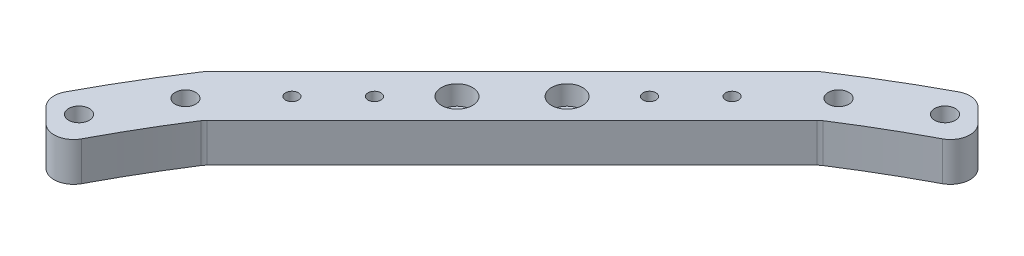
ISO-10303-21;
HEADER;
FILE_DESCRIPTION(('STEP AP214'),'2;1');
FILE_NAME('part.step','',(''),(''),'','','');
FILE_SCHEMA(('AUTOMOTIVE_DESIGN { 1 0 10303 214 1 1 1 1 }'));
ENDSEC;
DATA;
#1=APPLICATION_CONTEXT('core data for automotive mechanical design processes');
#2=APPLICATION_PROTOCOL_DEFINITION('international standard','automotive_design',2000,#1);
#3=PRODUCT_CONTEXT('',#1,'mechanical');
#4=PRODUCT('Part','Part','',(#3));
#5=PRODUCT_RELATED_PRODUCT_CATEGORY('part','',(#4));
#6=PRODUCT_DEFINITION_FORMATION('','',#4);
#7=PRODUCT_DEFINITION_CONTEXT('part definition',#1,'design');
#8=PRODUCT_DEFINITION('design','',#6,#7);
#9=PRODUCT_DEFINITION_SHAPE('','',#8);
#10=(LENGTH_UNIT() NAMED_UNIT(*) SI_UNIT(.MILLI.,.METRE.));
#11=(NAMED_UNIT(*) PLANE_ANGLE_UNIT() SI_UNIT($,.RADIAN.));
#12=(NAMED_UNIT(*) SI_UNIT($,.STERADIAN.) SOLID_ANGLE_UNIT());
#13=UNCERTAINTY_MEASURE_WITH_UNIT(LENGTH_MEASURE(1.E-05),#10,'distance_accuracy_value','');
#14=(GEOMETRIC_REPRESENTATION_CONTEXT(3) GLOBAL_UNCERTAINTY_ASSIGNED_CONTEXT((#13)) GLOBAL_UNIT_ASSIGNED_CONTEXT((#10,
#11,#12)) REPRESENTATION_CONTEXT('',''));
#15=CARTESIAN_POINT('',(0.,0.,0.));
#16=DIRECTION('',(0.,0.,1.));
#17=DIRECTION('',(1.,0.,0.));
#18=AXIS2_PLACEMENT_3D('',#15,#16,#17);
#19=CARTESIAN_POINT('',(-195.525945240556,5.33309524416875,-181.383809616824));
#20=DIRECTION('',(0.,1.,0.));
#21=DIRECTION('',(0.,0.,1.));
#22=AXIS2_PLACEMENT_3D('',#19,#20,#21);
#23=CYLINDRICAL_SURFACE('',#22,1.65000000000002);
#24=CARTESIAN_POINT('',(-195.525945240556,10.,-181.383809616824));
#25=DIRECTION('',(0.,1.,0.));
#26=DIRECTION('',(0.,0.,1.));
#27=AXIS2_PLACEMENT_3D('',#24,#25,#26);
#28=CIRCLE('',#27,1.65000000000002);
#29=CARTESIAN_POINT('',(-195.525945240556,10.,-179.733809616824));
#30=VERTEX_POINT('',#29);
#31=EDGE_CURVE('E299',#30,#30,#28,.F.);
#32=ORIENTED_EDGE('',*,*,#31,.T.);
#33=EDGE_LOOP('',(#32));
#34=FACE_BOUND('',#33,.T.);
#35=CARTESIAN_POINT('',(-195.525945240556,15.,-181.383809616824));
#36=DIRECTION('',(0.,1.,0.));
#37=DIRECTION('',(0.,0.,1.));
#38=AXIS2_PLACEMENT_3D('',#35,#36,#37);
#39=CIRCLE('',#38,1.65000000000002);
#40=CARTESIAN_POINT('',(-195.525945240556,15.,-179.733809616824));
#41=VERTEX_POINT('',#40);
#42=EDGE_CURVE('E217',#41,#41,#39,.F.);
#43=ORIENTED_EDGE('',*,*,#42,.F.);
#44=EDGE_LOOP('',(#43));
#45=FACE_BOUND('',#44,.T.);
#46=ADVANCED_FACE('F40',(#34,#45),#23,.F.);
#47=CARTESIAN_POINT('',(-181.383809616825,5.33309524416875,-195.525945240555));
#48=DIRECTION('',(0.,1.,0.));
#49=DIRECTION('',(0.,0.,1.));
#50=AXIS2_PLACEMENT_3D('',#47,#48,#49);
#51=CYLINDRICAL_SURFACE('',#50,1.65000000000002);
#52=CARTESIAN_POINT('',(-181.383809616825,10.,-195.525945240555));
#53=DIRECTION('',(0.,1.,0.));
#54=DIRECTION('',(0.,0.,1.));
#55=AXIS2_PLACEMENT_3D('',#52,#53,#54);
#56=CIRCLE('',#55,1.65000000000002);
#57=CARTESIAN_POINT('',(-181.383809616825,10.,-193.875945240555));
#58=VERTEX_POINT('',#57);
#59=EDGE_CURVE('E676',#58,#58,#56,.F.);
#60=ORIENTED_EDGE('',*,*,#59,.T.);
#61=EDGE_LOOP('',(#60));
#62=FACE_BOUND('',#61,.T.);
#63=CARTESIAN_POINT('',(-181.383809616825,15.,-195.525945240555));
#64=DIRECTION('',(0.,1.,0.));
#65=DIRECTION('',(0.,0.,1.));
#66=AXIS2_PLACEMENT_3D('',#63,#64,#65);
#67=CIRCLE('',#66,1.65000000000002);
#68=CARTESIAN_POINT('',(-181.383809616825,15.,-193.875945240555));
#69=VERTEX_POINT('',#68);
#70=EDGE_CURVE('E214',#69,#69,#67,.F.);
#71=ORIENTED_EDGE('',*,*,#70,.F.);
#72=EDGE_LOOP('',(#71));
#73=FACE_BOUND('',#72,.T.);
#74=ADVANCED_FACE('F343',(#62,#73),#51,.F.);
#75=CARTESIAN_POINT('',(0.,20.,0.));
#76=DIRECTION('',(0.,-1.,0.));
#77=DIRECTION('',(0.,0.,-1.));
#78=AXIS2_PLACEMENT_3D('',#75,#76,#77);
#79=CYLINDRICAL_SURFACE('',#78,280.);
#80=CARTESIAN_POINT('',(0.,10.,0.));
#81=DIRECTION('',(0.,1.,0.));
#82=DIRECTION('',(0.,0.,1.));
#83=AXIS2_PLACEMENT_3D('',#80,#81,#82);
#84=CIRCLE('',#83,280.);
#85=CARTESIAN_POINT('',(-233.869592113693,10.,-153.964326662299));
#86=VERTEX_POINT('',#85);
#87=CARTESIAN_POINT('',(-246.878251904902,10.,-132.102720397347));
#88=VERTEX_POINT('',#87);
#89=EDGE_CURVE('E188',#86,#88,#84,.T.);
#90=ORIENTED_EDGE('',*,*,#89,.T.);
#91=DIRECTION('',(0.,-1.,0.));
#92=VECTOR('',#91,1.);
#93=CARTESIAN_POINT('',(-246.878251904902,20.,-132.102720397347));
#94=LINE('',#93,#92);
#95=CARTESIAN_POINT('',(-246.878251904902,20.,-132.102720397347));
#96=VERTEX_POINT('',#95);
#97=EDGE_CURVE('E228',#88,#96,#94,.F.);
#98=ORIENTED_EDGE('',*,*,#97,.T.);
#99=CARTESIAN_POINT('',(0.,20.,0.));
#100=DIRECTION('',(0.,1.,0.));
#101=DIRECTION('',(0.,0.,1.));
#102=AXIS2_PLACEMENT_3D('',#99,#100,#101);
#103=CIRCLE('',#102,280.);
#104=CARTESIAN_POINT('',(-233.869592113693,20.,-153.964326662299));
#105=VERTEX_POINT('',#104);
#106=EDGE_CURVE('E197',#105,#96,#103,.T.);
#107=ORIENTED_EDGE('',*,*,#106,.F.);
#108=DIRECTION('',(0.,-1.,0.));
#109=VECTOR('',#108,1.);
#110=CARTESIAN_POINT('',(-233.869592113693,20.,-153.964326662299));
#111=LINE('',#110,#109);
#112=EDGE_CURVE('E226',#105,#86,#111,.T.);
#113=ORIENTED_EDGE('',*,*,#112,.T.);
#114=EDGE_LOOP('',(#90,#98,#107,#113));
#115=FACE_BOUND('',#114,.T.);
#116=ADVANCED_FACE('F338',(#115),#79,.T.);
#117=CARTESIAN_POINT('',(0.,20.,0.));
#118=DIRECTION('',(0.,-1.,0.));
#119=DIRECTION('',(0.,0.,-1.));
#120=AXIS2_PLACEMENT_3D('',#117,#118,#119);
#121=CYLINDRICAL_SURFACE('',#120,265.);
#122=CARTESIAN_POINT('',(0.,20.,0.));
#123=DIRECTION('',(0.,1.,0.));
#124=DIRECTION('',(0.,0.,1.));
#125=AXIS2_PLACEMENT_3D('',#122,#123,#124);
#126=CIRCLE('',#125,265.);
#127=CARTESIAN_POINT('',(-123.712289616012,20.,-234.350740126768));
#128=VERTEX_POINT('',#127);
#129=CARTESIAN_POINT('',(-143.097671148324,20.,-223.042723512618));
#130=VERTEX_POINT('',#129);
#131=EDGE_CURVE('E185',#128,#130,#126,.T.);
#132=ORIENTED_EDGE('',*,*,#131,.T.);
#133=DIRECTION('',(0.,-1.,0.));
#134=VECTOR('',#133,1.);
#135=CARTESIAN_POINT('',(-143.097671148324,20.,-223.042723512618));
#136=LINE('',#135,#134);
#137=CARTESIAN_POINT('',(-143.097671148324,10.,-223.042723512618));
#138=VERTEX_POINT('',#137);
#139=EDGE_CURVE('E55',#130,#138,#136,.T.);
#140=ORIENTED_EDGE('',*,*,#139,.T.);
#141=CARTESIAN_POINT('',(0.,10.,0.));
#142=DIRECTION('',(0.,1.,0.));
#143=DIRECTION('',(0.,0.,1.));
#144=AXIS2_PLACEMENT_3D('',#141,#142,#143);
#145=CIRCLE('',#144,265.);
#146=CARTESIAN_POINT('',(-123.712289616012,10.,-234.350740126768));
#147=VERTEX_POINT('',#146);
#148=EDGE_CURVE('E186',#147,#138,#145,.T.);
#149=ORIENTED_EDGE('',*,*,#148,.F.);
#150=DIRECTION('',(0.,-1.,0.));
#151=VECTOR('',#150,1.);
#152=CARTESIAN_POINT('',(-123.712289616012,20.,-234.350740126768));
#153=LINE('',#152,#151);
#154=EDGE_CURVE('E267',#147,#128,#153,.F.);
#155=ORIENTED_EDGE('',*,*,#154,.T.);
#156=EDGE_LOOP('',(#132,#140,#149,#155));
#157=FACE_BOUND('',#156,.T.);
#158=ADVANCED_FACE('F279',(#157),#121,.F.);
#159=CARTESIAN_POINT('',(0.,20.,0.));
#160=DIRECTION('',(0.,1.,0.));
#161=DIRECTION('',(0.,0.,1.));
#162=AXIS2_PLACEMENT_3D('',#159,#160,#161);
#163=PLANE('',#162);
#164=CARTESIAN_POINT('',(-181.383809616825,20.,-195.525945240555));
#165=DIRECTION('',(0.,1.,0.));
#166=DIRECTION('',(0.,0.,1.));
#167=AXIS2_PLACEMENT_3D('',#164,#165,#166);
#168=CIRCLE('',#167,3.99999999999999);
#169=CARTESIAN_POINT('',(-181.383809616825,20.,-191.525945240555));
#170=VERTEX_POINT('',#169);
#171=EDGE_CURVE('E715',#170,#170,#168,.T.);
#172=ORIENTED_EDGE('',*,*,#171,.F.);
#173=EDGE_LOOP('',(#172));
#174=FACE_BOUND('',#173,.T.);
#175=CARTESIAN_POINT('',(-195.525945240556,20.,-181.383809616824));
#176=DIRECTION('',(0.,1.,0.));
#177=DIRECTION('',(0.,0.,1.));
#178=AXIS2_PLACEMENT_3D('',#175,#176,#177);
#179=CIRCLE('',#178,3.99999999999999);
#180=CARTESIAN_POINT('',(-195.525945240556,20.,-177.383809616824));
#181=VERTEX_POINT('',#180);
#182=EDGE_CURVE('E672',#181,#181,#179,.T.);
#183=ORIENTED_EDGE('',*,*,#182,.F.);
#184=EDGE_LOOP('',(#183));
#185=FACE_BOUND('',#184,.T.);
#186=CARTESIAN_POINT('',(-160.170606181228,20.,-216.739148676152));
#187=DIRECTION('',(0.,1.,0.));
#188=DIRECTION('',(0.,0.,-1.));
#189=AXIS2_PLACEMENT_3D('',#186,#187,#188);
#190=CIRCLE('',#189,1.65000000000002);
#191=CARTESIAN_POINT('',(-160.170606181228,20.,-218.389148676152));
#192=VERTEX_POINT('',#191);
#193=EDGE_CURVE('E221',#192,#192,#190,.T.);
#194=ORIENTED_EDGE('',*,*,#193,.F.);
#195=EDGE_LOOP('',(#194));
#196=FACE_BOUND('',#195,.T.);
#197=CARTESIAN_POINT('',(-170.777207899026,20.,-206.132546958354));
#198=DIRECTION('',(0.,1.,0.));
#199=DIRECTION('',(0.,0.,-1.));
#200=AXIS2_PLACEMENT_3D('',#197,#198,#199);
#201=CIRCLE('',#200,1.65000000000002);
#202=CARTESIAN_POINT('',(-170.777207899026,20.,-207.782546958354));
#203=VERTEX_POINT('',#202);
#204=EDGE_CURVE('E681',#203,#203,#201,.T.);
#205=ORIENTED_EDGE('',*,*,#204,.F.);
#206=EDGE_LOOP('',(#205));
#207=FACE_BOUND('',#206,.T.);
#208=CARTESIAN_POINT('',(-216.739148676152,20.,-160.170606181228));
#209=DIRECTION('',(0.,1.,0.));
#210=DIRECTION('',(0.,0.,1.));
#211=AXIS2_PLACEMENT_3D('',#208,#209,#210);
#212=CIRCLE('',#211,1.65000000000002);
#213=CARTESIAN_POINT('',(-216.739148676152,20.,-158.520606181228));
#214=VERTEX_POINT('',#213);
#215=EDGE_CURVE('E669',#214,#214,#212,.T.);
#216=ORIENTED_EDGE('',*,*,#215,.F.);
#217=EDGE_LOOP('',(#216));
#218=FACE_BOUND('',#217,.T.);
#219=CARTESIAN_POINT('',(-206.132546958354,20.,-170.777207899026));
#220=DIRECTION('',(0.,1.,0.));
#221=DIRECTION('',(0.,0.,1.));
#222=AXIS2_PLACEMENT_3D('',#219,#220,#221);
#223=CIRCLE('',#222,1.65000000000002);
#224=CARTESIAN_POINT('',(-206.132546958354,20.,-169.127207899026));
#225=VERTEX_POINT('',#224);
#226=EDGE_CURVE('E663',#225,#225,#223,.T.);
#227=ORIENTED_EDGE('',*,*,#226,.F.);
#228=EDGE_LOOP('',(#227));
#229=FACE_BOUND('',#228,.T.);
#230=ORIENTED_EDGE('',*,*,#106,.T.);
#231=CARTESIAN_POINT('',(-242.469711692315,20.,-129.743743247394));
#232=DIRECTION('',(0.,1.,0.));
#233=DIRECTION('',(0.,0.,1.));
#234=AXIS2_PLACEMENT_3D('',#231,#232,#233);
#235=CIRCLE('',#234,5.);
#236=CARTESIAN_POINT('',(-246.005245598247,20.,-126.208209341462));
#237=VERTEX_POINT('',#236);
#238=EDGE_CURVE('E240',#96,#237,#235,.T.);
#239=ORIENTED_EDGE('',*,*,#238,.T.);
#240=DIRECTION('',(0.707106781186548,0.,0.707106781186547));
#241=VECTOR('',#240,1.);
#242=CARTESIAN_POINT('',(-248.610381894354,20.,-128.813345637568));
#243=LINE('',#242,#241);
#244=CARTESIAN_POINT('',(-242.307986110564,20.,-122.510949853778));
#245=VERTEX_POINT('',#244);
#246=EDGE_CURVE('E294',#237,#245,#243,.T.);
#247=ORIENTED_EDGE('',*,*,#246,.T.);
#248=CARTESIAN_POINT('',(-238.772452204631,20.,-126.046483759711));
#249=DIRECTION('',(0.,1.,0.));
#250=DIRECTION('',(0.,0.,1.));
#251=AXIS2_PLACEMENT_3D('',#248,#249,#250);
#252=CIRCLE('',#251,5.);
#253=CARTESIAN_POINT('',(-234.350740126768,20.,-123.712289616013));
#254=VERTEX_POINT('',#253);
#255=EDGE_CURVE('E184',#245,#254,#252,.T.);
#256=ORIENTED_EDGE('',*,*,#255,.T.);
#257=CARTESIAN_POINT('',(-223.042723512618,20.,-143.097671148324));
#258=VERTEX_POINT('',#257);
#259=EDGE_CURVE('E172',#258,#254,#126,.T.);
#260=ORIENTED_EDGE('',*,*,#259,.F.);
#261=CARTESIAN_POINT('',(-218.834370238795,20.,-140.397715088922));
#262=DIRECTION('',(0.,1.,0.));
#263=DIRECTION('',(0.,0.,1.));
#264=AXIS2_PLACEMENT_3D('',#261,#262,#263);
#265=CIRCLE('',#264,5.);
#266=CARTESIAN_POINT('',(-222.369904144727,20.,-143.933248994855));
#267=VERTEX_POINT('',#266);
#268=EDGE_CURVE('E154',#258,#267,#265,.F.);
#269=ORIENTED_EDGE('',*,*,#268,.T.);
#270=DIRECTION('',(0.707106781186548,0.,-0.707106781186547));
#271=VECTOR('',#270,1.);
#272=CARTESIAN_POINT('',(-222.749556316238,20.,-143.553596823344));
#273=LINE('',#272,#271);
#274=CARTESIAN_POINT('',(-143.933248994854,20.,-222.369904144728));
#275=VERTEX_POINT('',#274);
#276=EDGE_CURVE('E276',#267,#275,#273,.T.);
#277=ORIENTED_EDGE('',*,*,#276,.T.);
#278=CARTESIAN_POINT('',(-140.397715088922,20.,-218.834370238795));
#279=DIRECTION('',(0.,1.,0.));
#280=DIRECTION('',(0.,0.,1.));
#281=AXIS2_PLACEMENT_3D('',#278,#279,#280);
#282=CIRCLE('',#281,5.);
#283=EDGE_CURVE('E48',#275,#130,#282,.F.);
#284=ORIENTED_EDGE('',*,*,#283,.T.);
#285=ORIENTED_EDGE('',*,*,#131,.F.);
#286=CARTESIAN_POINT('',(-126.046483759711,20.,-238.772452204631));
#287=DIRECTION('',(0.,1.,0.));
#288=DIRECTION('',(0.,0.,1.));
#289=AXIS2_PLACEMENT_3D('',#286,#287,#288);
#290=CIRCLE('',#289,5.);
#291=CARTESIAN_POINT('',(-122.510949853778,20.,-242.307986110564));
#292=VERTEX_POINT('',#291);
#293=EDGE_CURVE('E231',#128,#292,#290,.T.);
#294=ORIENTED_EDGE('',*,*,#293,.T.);
#295=DIRECTION('',(-0.707106781186548,0.,-0.707106781186548));
#296=VECTOR('',#295,1.);
#297=CARTESIAN_POINT('',(-128.813345637568,20.,-248.610381894354));
#298=LINE('',#297,#296);
#299=CARTESIAN_POINT('',(-126.208209341462,20.,-246.005245598248));
#300=VERTEX_POINT('',#299);
#301=EDGE_CURVE('E305',#292,#300,#298,.T.);
#302=ORIENTED_EDGE('',*,*,#301,.T.);
#303=CARTESIAN_POINT('',(-129.743743247394,20.,-242.469711692315));
#304=DIRECTION('',(0.,1.,0.));
#305=DIRECTION('',(0.,0.,1.));
#306=AXIS2_PLACEMENT_3D('',#303,#304,#305);
#307=CIRCLE('',#306,5.);
#308=CARTESIAN_POINT('',(-132.102720397347,20.,-246.878251904902));
#309=VERTEX_POINT('',#308);
#310=EDGE_CURVE('E233',#300,#309,#307,.T.);
#311=ORIENTED_EDGE('',*,*,#310,.T.);
#312=CARTESIAN_POINT('',(-153.964326662299,20.,-233.869592113693));
#313=VERTEX_POINT('',#312);
#314=EDGE_CURVE('E194',#309,#313,#103,.T.);
#315=ORIENTED_EDGE('',*,*,#314,.T.);
#316=CARTESIAN_POINT('',(-151.214963686186,20.,-229.693349397377));
#317=DIRECTION('',(0.,1.,0.));
#318=DIRECTION('',(0.,0.,1.));
#319=AXIS2_PLACEMENT_3D('',#316,#317,#318);
#320=CIRCLE('',#319,5.);
#321=CARTESIAN_POINT('',(-154.750497592119,20.,-233.228883303309));
#322=VERTEX_POINT('',#321);
#323=EDGE_CURVE('E235',#313,#322,#320,.T.);
#324=ORIENTED_EDGE('',*,*,#323,.T.);
#325=DIRECTION('',(-0.707106781186548,0.,0.707106781186547));
#326=VECTOR('',#325,1.);
#327=CARTESIAN_POINT('',(-154.391710701268,20.,-233.587670194161));
#328=LINE('',#327,#326);
#329=CARTESIAN_POINT('',(-233.228883303309,20.,-154.750497592119));
#330=VERTEX_POINT('',#329);
#331=EDGE_CURVE('E296',#322,#330,#328,.T.);
#332=ORIENTED_EDGE('',*,*,#331,.T.);
#333=CARTESIAN_POINT('',(-229.693349397377,20.,-151.214963686186));
#334=DIRECTION('',(0.,1.,0.));
#335=DIRECTION('',(0.,0.,1.));
#336=AXIS2_PLACEMENT_3D('',#333,#334,#335);
#337=CIRCLE('',#336,5.);
#338=EDGE_CURVE('E237',#330,#105,#337,.T.);
#339=ORIENTED_EDGE('',*,*,#338,.T.);
#340=EDGE_LOOP('',(#230,#239,#247,#256,#260,#269,#277,#284,#285,#294,#302,#311,#315,#324,#332,#339));
#341=FACE_BOUND('',#340,.T.);
#342=CARTESIAN_POINT('',(-240.123330240531,20.,-128.811575357983));
#343=DIRECTION('',(0.,1.,0.));
#344=DIRECTION('',(0.,0.,-1.));
#345=AXIS2_PLACEMENT_3D('',#342,#343,#344);
#346=CIRCLE('',#345,2.64999999999998);
#347=CARTESIAN_POINT('',(-240.123330240531,20.,-131.461575357983));
#348=VERTEX_POINT('',#347);
#349=EDGE_CURVE('E314',#348,#348,#346,.T.);
#350=ORIENTED_EDGE('',*,*,#349,.F.);
#351=EDGE_LOOP('',(#350));
#352=FACE_BOUND('',#351,.T.);
#353=CARTESIAN_POINT('',(-230.028561881911,20.,-146.077022116924));
#354=DIRECTION('',(0.,1.,0.));
#355=DIRECTION('',(0.,0.,1.));
#356=AXIS2_PLACEMENT_3D('',#353,#354,#355);
#357=CIRCLE('',#356,2.65000000000002);
#358=CARTESIAN_POINT('',(-230.028561881911,20.,-143.427022116924));
#359=VERTEX_POINT('',#358);
#360=EDGE_CURVE('E315',#359,#359,#357,.T.);
#361=ORIENTED_EDGE('',*,*,#360,.F.);
#362=EDGE_LOOP('',(#361));
#363=FACE_BOUND('',#362,.T.);
#364=CARTESIAN_POINT('',(-128.811575357983,20.,-240.123330240531));
#365=DIRECTION('',(0.,1.,0.));
#366=DIRECTION('',(0.,0.,1.));
#367=AXIS2_PLACEMENT_3D('',#364,#365,#366);
#368=CIRCLE('',#367,2.65000000000002);
#369=CARTESIAN_POINT('',(-128.811575357983,20.,-237.473330240531));
#370=VERTEX_POINT('',#369);
#371=EDGE_CURVE('E205',#370,#370,#368,.T.);
#372=ORIENTED_EDGE('',*,*,#371,.F.);
#373=EDGE_LOOP('',(#372));
#374=FACE_BOUND('',#373,.T.);
#375=CARTESIAN_POINT('',(-146.077022116924,20.,-230.028561881911));
#376=DIRECTION('',(0.,1.,0.));
#377=DIRECTION('',(0.,0.,1.));
#378=AXIS2_PLACEMENT_3D('',#375,#376,#377);
#379=CIRCLE('',#378,2.65000000000002);
#380=CARTESIAN_POINT('',(-146.077022116924,20.,-227.378561881911));
#381=VERTEX_POINT('',#380);
#382=EDGE_CURVE('E191',#381,#381,#379,.T.);
#383=ORIENTED_EDGE('',*,*,#382,.F.);
#384=EDGE_LOOP('',(#383));
#385=FACE_BOUND('',#384,.T.);
#386=ADVANCED_FACE('F180',(#174,#185,#196,#207,#218,#229,#341,#352,#363,#374,#385),#163,.T.);
#387=CARTESIAN_POINT('',(0.,10.,0.));
#388=DIRECTION('',(0.,1.,0.));
#389=DIRECTION('',(0.,0.,1.));
#390=AXIS2_PLACEMENT_3D('',#387,#388,#389);
#391=PLANE('',#390);
#392=CARTESIAN_POINT('',(-160.170606181228,10.,-216.739148676152));
#393=DIRECTION('',(0.,1.,0.));
#394=DIRECTION('',(0.,0.,1.));
#395=AXIS2_PLACEMENT_3D('',#392,#393,#394);
#396=CIRCLE('',#395,1.65000000000002);
#397=CARTESIAN_POINT('',(-160.170606181228,10.,-215.089148676152));
#398=VERTEX_POINT('',#397);
#399=EDGE_CURVE('E684',#398,#398,#396,.F.);
#400=ORIENTED_EDGE('',*,*,#399,.F.);
#401=EDGE_LOOP('',(#400));
#402=FACE_BOUND('',#401,.T.);
#403=CARTESIAN_POINT('',(-170.777207899026,10.,-206.132546958354));
#404=DIRECTION('',(0.,1.,0.));
#405=DIRECTION('',(0.,0.,1.));
#406=AXIS2_PLACEMENT_3D('',#403,#404,#405);
#407=CIRCLE('',#406,1.65000000000002);
#408=CARTESIAN_POINT('',(-170.777207899026,10.,-204.482546958354));
#409=VERTEX_POINT('',#408);
#410=EDGE_CURVE('E680',#409,#409,#407,.F.);
#411=ORIENTED_EDGE('',*,*,#410,.F.);
#412=EDGE_LOOP('',(#411));
#413=FACE_BOUND('',#412,.T.);
#414=ORIENTED_EDGE('',*,*,#59,.F.);
#415=EDGE_LOOP('',(#414));
#416=FACE_BOUND('',#415,.T.);
#417=CARTESIAN_POINT('',(-216.739148676152,10.,-160.170606181228));
#418=DIRECTION('',(0.,1.,0.));
#419=DIRECTION('',(0.,0.,1.));
#420=AXIS2_PLACEMENT_3D('',#417,#418,#419);
#421=CIRCLE('',#420,1.65000000000002);
#422=CARTESIAN_POINT('',(-216.739148676152,10.,-158.520606181228));
#423=VERTEX_POINT('',#422);
#424=EDGE_CURVE('E665',#423,#423,#421,.F.);
#425=ORIENTED_EDGE('',*,*,#424,.F.);
#426=EDGE_LOOP('',(#425));
#427=FACE_BOUND('',#426,.T.);
#428=CARTESIAN_POINT('',(-206.132546958354,10.,-170.777207899026));
#429=DIRECTION('',(0.,1.,0.));
#430=DIRECTION('',(0.,0.,1.));
#431=AXIS2_PLACEMENT_3D('',#428,#429,#430);
#432=CIRCLE('',#431,1.65000000000002);
#433=CARTESIAN_POINT('',(-206.132546958354,10.,-169.127207899026));
#434=VERTEX_POINT('',#433);
#435=EDGE_CURVE('E660',#434,#434,#432,.F.);
#436=ORIENTED_EDGE('',*,*,#435,.F.);
#437=EDGE_LOOP('',(#436));
#438=FACE_BOUND('',#437,.T.);
#439=ORIENTED_EDGE('',*,*,#31,.F.);
#440=EDGE_LOOP('',(#439));
#441=FACE_BOUND('',#440,.T.);
#442=DIRECTION('',(0.707106781186548,0.,0.707106781186547));
#443=VECTOR('',#442,1.);
#444=CARTESIAN_POINT('',(-59.8985181283926,10.,59.8985181283928));
#445=LINE('',#444,#443);
#446=CARTESIAN_POINT('',(-246.005245598248,10.,-126.208209341462));
#447=VERTEX_POINT('',#446);
#448=CARTESIAN_POINT('',(-242.307986110564,10.,-122.510949853778));
#449=VERTEX_POINT('',#448);
#450=EDGE_CURVE('E308',#447,#449,#445,.T.);
#451=ORIENTED_EDGE('',*,*,#450,.F.);
#452=CARTESIAN_POINT('',(-242.469711692315,10.,-129.743743247394));
#453=DIRECTION('',(0.,1.,0.));
#454=DIRECTION('',(0.,0.,1.));
#455=AXIS2_PLACEMENT_3D('',#452,#453,#454);
#456=CIRCLE('',#455,5.);
#457=EDGE_CURVE('E255',#447,#88,#456,.F.);
#458=ORIENTED_EDGE('',*,*,#457,.T.);
#459=ORIENTED_EDGE('',*,*,#89,.F.);
#460=CARTESIAN_POINT('',(-229.693349397377,10.,-151.214963686186));
#461=DIRECTION('',(0.,1.,0.));
#462=DIRECTION('',(0.,0.,1.));
#463=AXIS2_PLACEMENT_3D('',#460,#461,#462);
#464=CIRCLE('',#463,5.);
#465=CARTESIAN_POINT('',(-233.228883303309,9.99999999999999,-154.750497592119));
#466=VERTEX_POINT('',#465);
#467=EDGE_CURVE('E251',#86,#466,#464,.F.);
#468=ORIENTED_EDGE('',*,*,#467,.T.);
#469=DIRECTION('',(0.707106781186548,0.,-0.707106781186547));
#470=VECTOR('',#469,1.);
#471=CARTESIAN_POINT('',(-154.391710701268,9.99999999999999,-233.587670194161));
#472=LINE('',#471,#470);
#473=CARTESIAN_POINT('',(-154.750497592119,9.99999999999999,-233.228883303309));
#474=VERTEX_POINT('',#473);
#475=EDGE_CURVE('E291',#466,#474,#472,.T.);
#476=ORIENTED_EDGE('',*,*,#475,.T.);
#477=CARTESIAN_POINT('',(-151.214963686186,10.,-229.693349397377));
#478=DIRECTION('',(0.,1.,0.));
#479=DIRECTION('',(0.,0.,1.));
#480=AXIS2_PLACEMENT_3D('',#477,#478,#479);
#481=CIRCLE('',#480,5.);
#482=CARTESIAN_POINT('',(-153.964326662299,10.,-233.869592113693));
#483=VERTEX_POINT('',#482);
#484=EDGE_CURVE('E249',#474,#483,#481,.F.);
#485=ORIENTED_EDGE('',*,*,#484,.T.);
#486=CARTESIAN_POINT('',(-132.102720397347,10.,-246.878251904902));
#487=VERTEX_POINT('',#486);
#488=EDGE_CURVE('E198',#487,#483,#84,.T.);
#489=ORIENTED_EDGE('',*,*,#488,.F.);
#490=CARTESIAN_POINT('',(-129.743743247394,10.,-242.469711692315));
#491=DIRECTION('',(0.,1.,0.));
#492=DIRECTION('',(0.,0.,1.));
#493=AXIS2_PLACEMENT_3D('',#490,#491,#492);
#494=CIRCLE('',#493,5.);
#495=CARTESIAN_POINT('',(-126.208209341462,10.,-246.005245598248));
#496=VERTEX_POINT('',#495);
#497=EDGE_CURVE('E247',#487,#496,#494,.F.);
#498=ORIENTED_EDGE('',*,*,#497,.T.);
#499=DIRECTION('',(-0.707106781186548,0.,-0.707106781186548));
#500=VECTOR('',#499,1.);
#501=CARTESIAN_POINT('',(59.8985181283929,10.,-59.8985181283929));
#502=LINE('',#501,#500);
#503=CARTESIAN_POINT('',(-122.510949853778,10.,-242.307986110564));
#504=VERTEX_POINT('',#503);
#505=EDGE_CURVE('E311',#504,#496,#502,.T.);
#506=ORIENTED_EDGE('',*,*,#505,.F.);
#507=CARTESIAN_POINT('',(-126.046483759711,10.,-238.772452204631));
#508=DIRECTION('',(0.,1.,0.));
#509=DIRECTION('',(0.,0.,1.));
#510=AXIS2_PLACEMENT_3D('',#507,#508,#509);
#511=CIRCLE('',#510,5.);
#512=EDGE_CURVE('E62',#504,#147,#511,.F.);
#513=ORIENTED_EDGE('',*,*,#512,.T.);
#514=ORIENTED_EDGE('',*,*,#148,.T.);
#515=CARTESIAN_POINT('',(-140.397715088922,10.,-218.834370238795));
#516=DIRECTION('',(0.,1.,0.));
#517=DIRECTION('',(0.,0.,1.));
#518=AXIS2_PLACEMENT_3D('',#515,#516,#517);
#519=CIRCLE('',#518,5.);
#520=CARTESIAN_POINT('',(-143.933248994854,9.99999999999999,-222.369904144728));
#521=VERTEX_POINT('',#520);
#522=EDGE_CURVE('E12',#138,#521,#519,.T.);
#523=ORIENTED_EDGE('',*,*,#522,.T.);
#524=DIRECTION('',(-0.707106781186548,0.,0.707106781186547));
#525=VECTOR('',#524,1.);
#526=CARTESIAN_POINT('',(-222.749556316238,9.99999999999999,-143.553596823344));
#527=LINE('',#526,#525);
#528=CARTESIAN_POINT('',(-222.369904144727,9.99999999999999,-143.933248994855));
#529=VERTEX_POINT('',#528);
#530=EDGE_CURVE('E288',#521,#529,#527,.T.);
#531=ORIENTED_EDGE('',*,*,#530,.T.);
#532=CARTESIAN_POINT('',(-218.834370238795,10.,-140.397715088922));
#533=DIRECTION('',(0.,1.,0.));
#534=DIRECTION('',(0.,0.,1.));
#535=AXIS2_PLACEMENT_3D('',#532,#533,#534);
#536=CIRCLE('',#535,5.);
#537=CARTESIAN_POINT('',(-223.042723512618,10.,-143.097671148324));
#538=VERTEX_POINT('',#537);
#539=EDGE_CURVE('E164',#529,#538,#536,.T.);
#540=ORIENTED_EDGE('',*,*,#539,.T.);
#541=CARTESIAN_POINT('',(-234.350740126768,10.,-123.712289616013));
#542=VERTEX_POINT('',#541);
#543=EDGE_CURVE('E175',#538,#542,#145,.T.);
#544=ORIENTED_EDGE('',*,*,#543,.T.);
#545=CARTESIAN_POINT('',(-238.772452204631,10.,-126.046483759711));
#546=DIRECTION('',(0.,1.,0.));
#547=DIRECTION('',(0.,0.,1.));
#548=AXIS2_PLACEMENT_3D('',#545,#546,#547);
#549=CIRCLE('',#548,5.);
#550=EDGE_CURVE('E253',#542,#449,#549,.F.);
#551=ORIENTED_EDGE('',*,*,#550,.T.);
#552=EDGE_LOOP('',(#451,#458,#459,#468,#476,#485,#489,#498,#506,#513,#514,#523,#531,#540,#544,#551));
#553=FACE_BOUND('',#552,.T.);
#554=CARTESIAN_POINT('',(-240.123330240531,10.,-128.811575357983));
#555=DIRECTION('',(0.,1.,0.));
#556=DIRECTION('',(0.,0.,1.));
#557=AXIS2_PLACEMENT_3D('',#554,#555,#556);
#558=CIRCLE('',#557,2.64999999999998);
#559=CARTESIAN_POINT('',(-240.123330240531,10.,-126.161575357984));
#560=VERTEX_POINT('',#559);
#561=EDGE_CURVE('E208',#560,#560,#558,.T.);
#562=ORIENTED_EDGE('',*,*,#561,.T.);
#563=EDGE_LOOP('',(#562));
#564=FACE_BOUND('',#563,.T.);
#565=CARTESIAN_POINT('',(-230.028561881911,10.,-146.077022116924));
#566=DIRECTION('',(0.,1.,0.));
#567=DIRECTION('',(0.,0.,1.));
#568=AXIS2_PLACEMENT_3D('',#565,#566,#567);
#569=CIRCLE('',#568,2.65000000000002);
#570=CARTESIAN_POINT('',(-230.028561881911,10.,-143.427022116924));
#571=VERTEX_POINT('',#570);
#572=EDGE_CURVE('E211',#571,#571,#569,.T.);
#573=ORIENTED_EDGE('',*,*,#572,.T.);
#574=EDGE_LOOP('',(#573));
#575=FACE_BOUND('',#574,.T.);
#576=CARTESIAN_POINT('',(-128.811575357983,10.,-240.123330240531));
#577=DIRECTION('',(0.,1.,0.));
#578=DIRECTION('',(0.,0.,1.));
#579=AXIS2_PLACEMENT_3D('',#576,#577,#578);
#580=CIRCLE('',#579,2.65000000000002);
#581=CARTESIAN_POINT('',(-128.811575357983,10.,-237.473330240531));
#582=VERTEX_POINT('',#581);
#583=EDGE_CURVE('E204',#582,#582,#580,.T.);
#584=ORIENTED_EDGE('',*,*,#583,.T.);
#585=EDGE_LOOP('',(#584));
#586=FACE_BOUND('',#585,.T.);
#587=CARTESIAN_POINT('',(-146.077022116924,10.,-230.028561881911));
#588=DIRECTION('',(0.,1.,0.));
#589=DIRECTION('',(0.,0.,1.));
#590=AXIS2_PLACEMENT_3D('',#587,#588,#589);
#591=CIRCLE('',#590,2.65000000000002);
#592=CARTESIAN_POINT('',(-146.077022116924,10.,-227.378561881911));
#593=VERTEX_POINT('',#592);
#594=EDGE_CURVE('E201',#593,#593,#591,.T.);
#595=ORIENTED_EDGE('',*,*,#594,.T.);
#596=EDGE_LOOP('',(#595));
#597=FACE_BOUND('',#596,.T.);
#598=ADVANCED_FACE('F286',(#402,#413,#416,#427,#438,#441,#553,#564,#575,#586,#597),#391,.F.);
#599=ORIENTED_EDGE('',*,*,#488,.T.);
#600=DIRECTION('',(0.,-1.,0.));
#601=VECTOR('',#600,1.);
#602=CARTESIAN_POINT('',(-153.964326662299,20.,-233.869592113693));
#603=LINE('',#602,#601);
#604=EDGE_CURVE('E264',#483,#313,#603,.F.);
#605=ORIENTED_EDGE('',*,*,#604,.T.);
#606=ORIENTED_EDGE('',*,*,#314,.F.);
#607=DIRECTION('',(0.,-1.,0.));
#608=VECTOR('',#607,1.);
#609=CARTESIAN_POINT('',(-132.102720397347,20.,-246.878251904902));
#610=LINE('',#609,#608);
#611=EDGE_CURVE('E262',#309,#487,#610,.T.);
#612=ORIENTED_EDGE('',*,*,#611,.T.);
#613=EDGE_LOOP('',(#599,#605,#606,#612));
#614=FACE_BOUND('',#613,.T.);
#615=ADVANCED_FACE('F335',(#614),#79,.T.);
#616=ORIENTED_EDGE('',*,*,#543,.F.);
#617=DIRECTION('',(0.,-1.,0.));
#618=VECTOR('',#617,1.);
#619=CARTESIAN_POINT('',(-223.042723512618,20.,-143.097671148324));
#620=LINE('',#619,#618);
#621=EDGE_CURVE('E158',#538,#258,#620,.F.);
#622=ORIENTED_EDGE('',*,*,#621,.T.);
#623=ORIENTED_EDGE('',*,*,#259,.T.);
#624=DIRECTION('',(0.,-1.,0.));
#625=VECTOR('',#624,1.);
#626=CARTESIAN_POINT('',(-234.350740126768,20.,-123.712289616013));
#627=LINE('',#626,#625);
#628=EDGE_CURVE('E177',#254,#542,#627,.T.);
#629=ORIENTED_EDGE('',*,*,#628,.T.);
#630=EDGE_LOOP('',(#616,#622,#623,#629));
#631=FACE_BOUND('',#630,.T.);
#632=ADVANCED_FACE('F170',(#631),#121,.F.);
#633=CARTESIAN_POINT('',(-146.077022116924,0.,-230.028561881911));
#634=DIRECTION('',(0.,1.,0.));
#635=DIRECTION('',(0.,0.,1.));
#636=AXIS2_PLACEMENT_3D('',#633,#634,#635);
#637=CYLINDRICAL_SURFACE('',#636,2.65000000000002);
#638=ORIENTED_EDGE('',*,*,#382,.T.);
#639=EDGE_LOOP('',(#638));
#640=FACE_BOUND('',#639,.T.);
#641=ORIENTED_EDGE('',*,*,#594,.F.);
#642=EDGE_LOOP('',(#641));
#643=FACE_BOUND('',#642,.T.);
#644=ADVANCED_FACE('F325',(#640,#643),#637,.F.);
#645=CARTESIAN_POINT('',(-128.811575357983,0.,-240.123330240531));
#646=DIRECTION('',(0.,1.,0.));
#647=DIRECTION('',(0.,0.,1.));
#648=AXIS2_PLACEMENT_3D('',#645,#646,#647);
#649=CYLINDRICAL_SURFACE('',#648,2.65000000000002);
#650=ORIENTED_EDGE('',*,*,#371,.T.);
#651=EDGE_LOOP('',(#650));
#652=FACE_BOUND('',#651,.T.);
#653=ORIENTED_EDGE('',*,*,#583,.F.);
#654=EDGE_LOOP('',(#653));
#655=FACE_BOUND('',#654,.T.);
#656=ADVANCED_FACE('F379',(#652,#655),#649,.F.);
#657=CARTESIAN_POINT('',(-240.123330240531,0.,-128.811575357983));
#658=DIRECTION('',(0.,1.,0.));
#659=DIRECTION('',(0.,0.,1.));
#660=AXIS2_PLACEMENT_3D('',#657,#658,#659);
#661=CYLINDRICAL_SURFACE('',#660,2.64999999999998);
#662=ORIENTED_EDGE('',*,*,#349,.T.);
#663=EDGE_LOOP('',(#662));
#664=FACE_BOUND('',#663,.T.);
#665=ORIENTED_EDGE('',*,*,#561,.F.);
#666=EDGE_LOOP('',(#665));
#667=FACE_BOUND('',#666,.T.);
#668=ADVANCED_FACE('F375',(#664,#667),#661,.F.);
#669=CARTESIAN_POINT('',(-230.028561881911,0.,-146.077022116924));
#670=DIRECTION('',(0.,1.,0.));
#671=DIRECTION('',(0.,0.,1.));
#672=AXIS2_PLACEMENT_3D('',#669,#670,#671);
#673=CYLINDRICAL_SURFACE('',#672,2.65000000000002);
#674=ORIENTED_EDGE('',*,*,#360,.T.);
#675=EDGE_LOOP('',(#674));
#676=FACE_BOUND('',#675,.T.);
#677=ORIENTED_EDGE('',*,*,#572,.F.);
#678=EDGE_LOOP('',(#677));
#679=FACE_BOUND('',#678,.T.);
#680=ADVANCED_FACE('F371',(#676,#679),#673,.F.);
#681=CARTESIAN_POINT('',(-248.610381894354,0.,-128.813345637568));
#682=DIRECTION('',(-0.707106781186547,0.,0.707106781186548));
#683=DIRECTION('',(0.707106781186548,0.,0.707106781186547));
#684=AXIS2_PLACEMENT_3D('',#681,#682,#683);
#685=PLANE('',#684);
#686=ORIENTED_EDGE('',*,*,#246,.F.);
#687=DIRECTION('',(0.,1.,0.));
#688=VECTOR('',#687,1.);
#689=CARTESIAN_POINT('',(-246.005245598247,10.,-126.208209341462));
#690=LINE('',#689,#688);
#691=EDGE_CURVE('E244',#237,#447,#690,.F.);
#692=ORIENTED_EDGE('',*,*,#691,.T.);
#693=ORIENTED_EDGE('',*,*,#450,.T.);
#694=DIRECTION('',(0.,-1.,0.));
#695=VECTOR('',#694,1.);
#696=CARTESIAN_POINT('',(-242.307986110564,0.,-122.510949853778));
#697=LINE('',#696,#695);
#698=EDGE_CURVE('E242',#449,#245,#697,.F.);
#699=ORIENTED_EDGE('',*,*,#698,.T.);
#700=EDGE_LOOP('',(#686,#692,#693,#699));
#701=FACE_BOUND('',#700,.T.);
#702=ADVANCED_FACE('F367',(#701),#685,.T.);
#703=CARTESIAN_POINT('',(-128.813345637568,0.,-248.610381894354));
#704=DIRECTION('',(0.707106781186548,0.,-0.707106781186548));
#705=DIRECTION('',(-0.707106781186548,0.,-0.707106781186548));
#706=AXIS2_PLACEMENT_3D('',#703,#704,#705);
#707=PLANE('',#706);
#708=ORIENTED_EDGE('',*,*,#505,.T.);
#709=DIRECTION('',(0.,1.,0.));
#710=VECTOR('',#709,1.);
#711=CARTESIAN_POINT('',(-126.208209341462,20.,-246.005245598248));
#712=LINE('',#711,#710);
#713=EDGE_CURVE('E165',#496,#300,#712,.T.);
#714=ORIENTED_EDGE('',*,*,#713,.T.);
#715=ORIENTED_EDGE('',*,*,#301,.F.);
#716=DIRECTION('',(0.,-1.,0.));
#717=VECTOR('',#716,1.);
#718=CARTESIAN_POINT('',(-122.510949853778,0.,-242.307986110564));
#719=LINE('',#718,#717);
#720=EDGE_CURVE('E271',#292,#504,#719,.T.);
#721=ORIENTED_EDGE('',*,*,#720,.T.);
#722=EDGE_LOOP('',(#708,#714,#715,#721));
#723=FACE_BOUND('',#722,.T.);
#724=ADVANCED_FACE('F363',(#723),#707,.T.);
#725=CARTESIAN_POINT('',(-154.391710701268,-117.327407636703,-233.587670194161));
#726=DIRECTION('',(-0.707106781186547,0.,-0.707106781186548));
#727=DIRECTION('',(-0.707106781186548,0.,0.707106781186547));
#728=AXIS2_PLACEMENT_3D('',#725,#726,#727);
#729=PLANE('',#728);
#730=ORIENTED_EDGE('',*,*,#475,.F.);
#731=DIRECTION('',(0.,1.,0.));
#732=VECTOR('',#731,1.);
#733=CARTESIAN_POINT('',(-233.228883303309,20.,-154.750497592119));
#734=LINE('',#733,#732);
#735=EDGE_CURVE('E259',#466,#330,#734,.T.);
#736=ORIENTED_EDGE('',*,*,#735,.T.);
#737=ORIENTED_EDGE('',*,*,#331,.F.);
#738=DIRECTION('',(0.,1.,0.));
#739=VECTOR('',#738,1.);
#740=CARTESIAN_POINT('',(-154.750497592119,10.,-233.228883303309));
#741=LINE('',#740,#739);
#742=EDGE_CURVE('E257',#322,#474,#741,.F.);
#743=ORIENTED_EDGE('',*,*,#742,.T.);
#744=EDGE_LOOP('',(#730,#736,#737,#743));
#745=FACE_BOUND('',#744,.T.);
#746=ADVANCED_FACE('F360',(#745),#729,.T.);
#747=CARTESIAN_POINT('',(-222.749556316238,-117.327407636703,-143.553596823344));
#748=DIRECTION('',(0.707106781186547,0.,0.707106781186548));
#749=DIRECTION('',(0.707106781186548,0.,-0.707106781186547));
#750=AXIS2_PLACEMENT_3D('',#747,#748,#749);
#751=PLANE('',#750);
#752=ORIENTED_EDGE('',*,*,#276,.F.);
#753=DIRECTION('',(0.,1.,0.));
#754=VECTOR('',#753,1.);
#755=CARTESIAN_POINT('',(-222.369904144727,10.,-143.933248994855));
#756=LINE('',#755,#754);
#757=EDGE_CURVE('E159',#267,#529,#756,.F.);
#758=ORIENTED_EDGE('',*,*,#757,.T.);
#759=ORIENTED_EDGE('',*,*,#530,.F.);
#760=DIRECTION('',(0.,1.,0.));
#761=VECTOR('',#760,1.);
#762=CARTESIAN_POINT('',(-143.933248994854,20.,-222.369904144728));
#763=LINE('',#762,#761);
#764=EDGE_CURVE('E176',#521,#275,#763,.T.);
#765=ORIENTED_EDGE('',*,*,#764,.T.);
#766=EDGE_LOOP('',(#752,#758,#759,#765));
#767=FACE_BOUND('',#766,.T.);
#768=ADVANCED_FACE('F290',(#767),#751,.T.);
#769=CARTESIAN_POINT('',(-206.132546958354,5.33309524416875,-170.777207899026));
#770=DIRECTION('',(0.,1.,0.));
#771=DIRECTION('',(0.,0.,1.));
#772=AXIS2_PLACEMENT_3D('',#769,#770,#771);
#773=CYLINDRICAL_SURFACE('',#772,1.65000000000002);
#774=ORIENTED_EDGE('',*,*,#435,.T.);
#775=EDGE_LOOP('',(#774));
#776=FACE_BOUND('',#775,.T.);
#777=ORIENTED_EDGE('',*,*,#226,.T.);
#778=EDGE_LOOP('',(#777));
#779=FACE_BOUND('',#778,.T.);
#780=ADVANCED_FACE('F359',(#776,#779),#773,.F.);
#781=CARTESIAN_POINT('',(-216.739148676152,5.33309524416875,-160.170606181228));
#782=DIRECTION('',(0.,1.,0.));
#783=DIRECTION('',(0.,0.,1.));
#784=AXIS2_PLACEMENT_3D('',#781,#782,#783);
#785=CYLINDRICAL_SURFACE('',#784,1.65000000000002);
#786=ORIENTED_EDGE('',*,*,#424,.T.);
#787=EDGE_LOOP('',(#786));
#788=FACE_BOUND('',#787,.T.);
#789=ORIENTED_EDGE('',*,*,#215,.T.);
#790=EDGE_LOOP('',(#789));
#791=FACE_BOUND('',#790,.T.);
#792=ADVANCED_FACE('F614',(#788,#791),#785,.F.);
#793=CARTESIAN_POINT('',(-170.777207899026,5.33309524416875,-206.132546958354));
#794=DIRECTION('',(0.,1.,0.));
#795=DIRECTION('',(0.,0.,1.));
#796=AXIS2_PLACEMENT_3D('',#793,#794,#795);
#797=CYLINDRICAL_SURFACE('',#796,1.65000000000002);
#798=ORIENTED_EDGE('',*,*,#410,.T.);
#799=EDGE_LOOP('',(#798));
#800=FACE_BOUND('',#799,.T.);
#801=ORIENTED_EDGE('',*,*,#204,.T.);
#802=EDGE_LOOP('',(#801));
#803=FACE_BOUND('',#802,.T.);
#804=ADVANCED_FACE('F605',(#800,#803),#797,.F.);
#805=CARTESIAN_POINT('',(-160.170606181228,5.33309524416875,-216.739148676152));
#806=DIRECTION('',(0.,1.,0.));
#807=DIRECTION('',(0.,0.,1.));
#808=AXIS2_PLACEMENT_3D('',#805,#806,#807);
#809=CYLINDRICAL_SURFACE('',#808,1.65000000000002);
#810=ORIENTED_EDGE('',*,*,#399,.T.);
#811=EDGE_LOOP('',(#810));
#812=FACE_BOUND('',#811,.T.);
#813=ORIENTED_EDGE('',*,*,#193,.T.);
#814=EDGE_LOOP('',(#813));
#815=FACE_BOUND('',#814,.T.);
#816=ADVANCED_FACE('F355',(#812,#815),#809,.F.);
#817=CARTESIAN_POINT('',(-181.383809616825,15.,-195.525945240555));
#818=DIRECTION('',(0.,1.,0.));
#819=DIRECTION('',(0.,0.,1.));
#820=AXIS2_PLACEMENT_3D('',#817,#818,#819);
#821=PLANE('',#820);
#822=CARTESIAN_POINT('',(-181.383809616825,15.,-195.525945240555));
#823=DIRECTION('',(0.,1.,0.));
#824=DIRECTION('',(0.,0.,1.));
#825=AXIS2_PLACEMENT_3D('',#822,#823,#824);
#826=CIRCLE('',#825,3.99999999999999);
#827=CARTESIAN_POINT('',(-181.383809616825,15.,-191.525945240555));
#828=VERTEX_POINT('',#827);
#829=EDGE_CURVE('E218',#828,#828,#826,.T.);
#830=ORIENTED_EDGE('',*,*,#829,.T.);
#831=EDGE_LOOP('',(#830));
#832=FACE_BOUND('',#831,.T.);
#833=ORIENTED_EDGE('',*,*,#70,.T.);
#834=EDGE_LOOP('',(#833));
#835=FACE_BOUND('',#834,.T.);
#836=ADVANCED_FACE('F576',(#832,#835),#821,.T.);
#837=CARTESIAN_POINT('',(-181.383809616825,15.,-195.525945240555));
#838=DIRECTION('',(0.,1.,0.));
#839=DIRECTION('',(0.,0.,1.));
#840=AXIS2_PLACEMENT_3D('',#837,#838,#839);
#841=CYLINDRICAL_SURFACE('',#840,3.99999999999999);
#842=ORIENTED_EDGE('',*,*,#829,.F.);
#843=EDGE_LOOP('',(#842));
#844=FACE_BOUND('',#843,.T.);
#845=ORIENTED_EDGE('',*,*,#171,.T.);
#846=EDGE_LOOP('',(#845));
#847=FACE_BOUND('',#846,.T.);
#848=ADVANCED_FACE('F566',(#844,#847),#841,.F.);
#849=CARTESIAN_POINT('',(-195.525945240556,15.,-181.383809616824));
#850=DIRECTION('',(0.,1.,0.));
#851=DIRECTION('',(0.,0.,1.));
#852=AXIS2_PLACEMENT_3D('',#849,#850,#851);
#853=PLANE('',#852);
#854=CARTESIAN_POINT('',(-195.525945240556,15.,-181.383809616824));
#855=DIRECTION('',(0.,1.,0.));
#856=DIRECTION('',(0.,0.,1.));
#857=AXIS2_PLACEMENT_3D('',#854,#855,#856);
#858=CIRCLE('',#857,3.99999999999999);
#859=CARTESIAN_POINT('',(-195.525945240556,15.,-177.383809616824));
#860=VERTEX_POINT('',#859);
#861=EDGE_CURVE('E712',#860,#860,#858,.T.);
#862=ORIENTED_EDGE('',*,*,#861,.T.);
#863=EDGE_LOOP('',(#862));
#864=FACE_BOUND('',#863,.T.);
#865=ORIENTED_EDGE('',*,*,#42,.T.);
#866=EDGE_LOOP('',(#865));
#867=FACE_BOUND('',#866,.T.);
#868=ADVANCED_FACE('F556',(#864,#867),#853,.T.);
#869=CARTESIAN_POINT('',(-195.525945240556,15.,-181.383809616824));
#870=DIRECTION('',(0.,1.,0.));
#871=DIRECTION('',(0.,0.,1.));
#872=AXIS2_PLACEMENT_3D('',#869,#870,#871);
#873=CYLINDRICAL_SURFACE('',#872,3.99999999999999);
#874=ORIENTED_EDGE('',*,*,#861,.F.);
#875=EDGE_LOOP('',(#874));
#876=FACE_BOUND('',#875,.T.);
#877=ORIENTED_EDGE('',*,*,#182,.T.);
#878=EDGE_LOOP('',(#877));
#879=FACE_BOUND('',#878,.T.);
#880=ADVANCED_FACE('F490',(#876,#879),#873,.F.);
#881=CARTESIAN_POINT('',(-218.834370238795,20.,-140.397715088922));
#882=DIRECTION('',(0.,-1.,0.));
#883=DIRECTION('',(0.,0.,-1.));
#884=AXIS2_PLACEMENT_3D('',#881,#882,#883);
#885=CYLINDRICAL_SURFACE('',#884,5.);
#886=ORIENTED_EDGE('',*,*,#539,.F.);
#887=ORIENTED_EDGE('',*,*,#757,.F.);
#888=ORIENTED_EDGE('',*,*,#268,.F.);
#889=ORIENTED_EDGE('',*,*,#621,.F.);
#890=EDGE_LOOP('',(#886,#887,#888,#889));
#891=FACE_BOUND('',#890,.T.);
#892=ADVANCED_FACE('F157',(#891),#885,.F.);
#893=CARTESIAN_POINT('',(-242.469711692315,20.,-129.743743247394));
#894=DIRECTION('',(0.,-1.,0.));
#895=DIRECTION('',(0.,0.,-1.));
#896=AXIS2_PLACEMENT_3D('',#893,#894,#895);
#897=CYLINDRICAL_SURFACE('',#896,5.);
#898=ORIENTED_EDGE('',*,*,#457,.F.);
#899=ORIENTED_EDGE('',*,*,#691,.F.);
#900=ORIENTED_EDGE('',*,*,#238,.F.);
#901=ORIENTED_EDGE('',*,*,#97,.F.);
#902=EDGE_LOOP('',(#898,#899,#900,#901));
#903=FACE_BOUND('',#902,.T.);
#904=ADVANCED_FACE('F405',(#903),#897,.T.);
#905=CARTESIAN_POINT('',(-238.772452204631,20.,-126.046483759711));
#906=DIRECTION('',(0.,-1.,0.));
#907=DIRECTION('',(0.,0.,-1.));
#908=AXIS2_PLACEMENT_3D('',#905,#906,#907);
#909=CYLINDRICAL_SURFACE('',#908,5.);
#910=ORIENTED_EDGE('',*,*,#255,.F.);
#911=ORIENTED_EDGE('',*,*,#698,.F.);
#912=ORIENTED_EDGE('',*,*,#550,.F.);
#913=ORIENTED_EDGE('',*,*,#628,.F.);
#914=EDGE_LOOP('',(#910,#911,#912,#913));
#915=FACE_BOUND('',#914,.T.);
#916=ADVANCED_FACE('F410',(#915),#909,.T.);
#917=CARTESIAN_POINT('',(-229.693349397377,20.,-151.214963686186));
#918=DIRECTION('',(0.,-1.,0.));
#919=DIRECTION('',(0.,0.,-1.));
#920=AXIS2_PLACEMENT_3D('',#917,#918,#919);
#921=CYLINDRICAL_SURFACE('',#920,5.);
#922=ORIENTED_EDGE('',*,*,#467,.F.);
#923=ORIENTED_EDGE('',*,*,#112,.F.);
#924=ORIENTED_EDGE('',*,*,#338,.F.);
#925=ORIENTED_EDGE('',*,*,#735,.F.);
#926=EDGE_LOOP('',(#922,#923,#924,#925));
#927=FACE_BOUND('',#926,.T.);
#928=ADVANCED_FACE('F412',(#927),#921,.T.);
#929=CARTESIAN_POINT('',(-151.214963686186,20.,-229.693349397377));
#930=DIRECTION('',(0.,-1.,0.));
#931=DIRECTION('',(0.,0.,-1.));
#932=AXIS2_PLACEMENT_3D('',#929,#930,#931);
#933=CYLINDRICAL_SURFACE('',#932,5.);
#934=ORIENTED_EDGE('',*,*,#484,.F.);
#935=ORIENTED_EDGE('',*,*,#742,.F.);
#936=ORIENTED_EDGE('',*,*,#323,.F.);
#937=ORIENTED_EDGE('',*,*,#604,.F.);
#938=EDGE_LOOP('',(#934,#935,#936,#937));
#939=FACE_BOUND('',#938,.T.);
#940=ADVANCED_FACE('F418',(#939),#933,.T.);
#941=CARTESIAN_POINT('',(-140.397715088922,20.,-218.834370238795));
#942=DIRECTION('',(0.,-1.,0.));
#943=DIRECTION('',(0.,0.,-1.));
#944=AXIS2_PLACEMENT_3D('',#941,#942,#943);
#945=CYLINDRICAL_SURFACE('',#944,5.);
#946=ORIENTED_EDGE('',*,*,#522,.F.);
#947=ORIENTED_EDGE('',*,*,#139,.F.);
#948=ORIENTED_EDGE('',*,*,#283,.F.);
#949=ORIENTED_EDGE('',*,*,#764,.F.);
#950=EDGE_LOOP('',(#946,#947,#948,#949));
#951=FACE_BOUND('',#950,.T.);
#952=ADVANCED_FACE('F282',(#951),#945,.F.);
#953=CARTESIAN_POINT('',(-129.743743247394,20.,-242.469711692315));
#954=DIRECTION('',(0.,-1.,0.));
#955=DIRECTION('',(0.,0.,-1.));
#956=AXIS2_PLACEMENT_3D('',#953,#954,#955);
#957=CYLINDRICAL_SURFACE('',#956,5.);
#958=ORIENTED_EDGE('',*,*,#497,.F.);
#959=ORIENTED_EDGE('',*,*,#611,.F.);
#960=ORIENTED_EDGE('',*,*,#310,.F.);
#961=ORIENTED_EDGE('',*,*,#713,.F.);
#962=EDGE_LOOP('',(#958,#959,#960,#961));
#963=FACE_BOUND('',#962,.T.);
#964=ADVANCED_FACE('F427',(#963),#957,.T.);
#965=CARTESIAN_POINT('',(-126.046483759711,20.,-238.772452204631));
#966=DIRECTION('',(0.,-1.,0.));
#967=DIRECTION('',(0.,0.,-1.));
#968=AXIS2_PLACEMENT_3D('',#965,#966,#967);
#969=CYLINDRICAL_SURFACE('',#968,5.);
#970=ORIENTED_EDGE('',*,*,#512,.F.);
#971=ORIENTED_EDGE('',*,*,#720,.F.);
#972=ORIENTED_EDGE('',*,*,#293,.F.);
#973=ORIENTED_EDGE('',*,*,#154,.F.);
#974=EDGE_LOOP('',(#970,#971,#972,#973));
#975=FACE_BOUND('',#974,.T.);
#976=ADVANCED_FACE('F42',(#975),#969,.T.);
#977=CLOSED_SHELL('',(#46,#74,#116,#158,#386,#598,#615,#632,#644,#656,#668,#680,#702,#724,#746,
#768,#780,#792,#804,#816,#836,#848,#868,#880,#892,#904,#916,#928,#940,#952,#964,#976));
#978=MANIFOLD_SOLID_BREP('B2',#977);
#979=ADVANCED_BREP_SHAPE_REPRESENTATION('',(#18,#978),#14);
#980=SHAPE_DEFINITION_REPRESENTATION(#9,#979);
ENDSEC;
END-ISO-10303-21;
